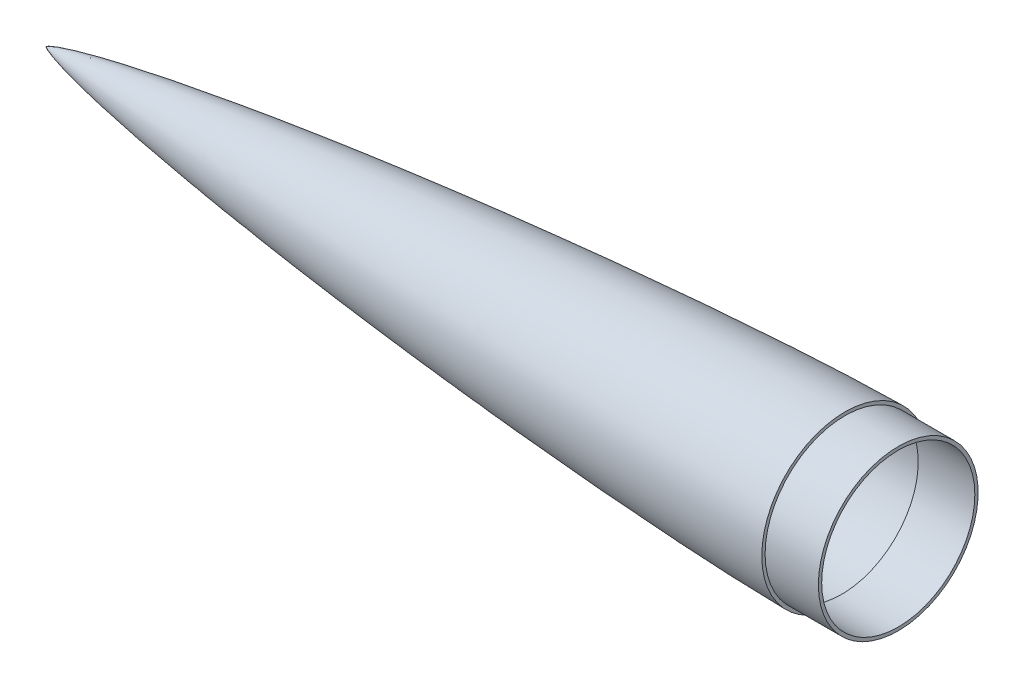
ISO-10303-21;
HEADER;
FILE_DESCRIPTION(('STEP AP214'),'2;1');
FILE_NAME('part.step','',(''),(''),'','','');
FILE_SCHEMA(('AUTOMOTIVE_DESIGN { 1 0 10303 214 1 1 1 1 }'));
ENDSEC;
DATA;
#1=APPLICATION_CONTEXT('core data for automotive mechanical design processes');
#2=APPLICATION_PROTOCOL_DEFINITION('international standard','automotive_design',2000,#1);
#3=PRODUCT_CONTEXT('',#1,'mechanical');
#4=PRODUCT('Part','Part','',(#3));
#5=PRODUCT_RELATED_PRODUCT_CATEGORY('part','',(#4));
#6=PRODUCT_DEFINITION_FORMATION('','',#4);
#7=PRODUCT_DEFINITION_CONTEXT('part definition',#1,'design');
#8=PRODUCT_DEFINITION('design','',#6,#7);
#9=PRODUCT_DEFINITION_SHAPE('','',#8);
#10=(LENGTH_UNIT() NAMED_UNIT(*) SI_UNIT(.MILLI.,.METRE.));
#11=(NAMED_UNIT(*) PLANE_ANGLE_UNIT() SI_UNIT($,.RADIAN.));
#12=(NAMED_UNIT(*) SI_UNIT($,.STERADIAN.) SOLID_ANGLE_UNIT());
#13=UNCERTAINTY_MEASURE_WITH_UNIT(LENGTH_MEASURE(1.E-05),#10,'distance_accuracy_value','');
#14=(GEOMETRIC_REPRESENTATION_CONTEXT(3) GLOBAL_UNCERTAINTY_ASSIGNED_CONTEXT((#13)) GLOBAL_UNIT_ASSIGNED_CONTEXT((#10,
#11,#12)) REPRESENTATION_CONTEXT('',''));
#15=CARTESIAN_POINT('',(0.,0.,0.));
#16=DIRECTION('',(0.,0.,1.));
#17=DIRECTION('',(1.,0.,0.));
#18=AXIS2_PLACEMENT_3D('',#15,#16,#17);
#19=CARTESIAN_POINT('',(0.,0.,0.));
#20=CARTESIAN_POINT('',(0.00304978367792177,0.00739151674115165,0.));
#21=CARTESIAN_POINT('',(0.0105162480931291,0.0213481993707133,0.));
#22=CARTESIAN_POINT('',(0.031106970511013,0.0458297069783124,0.));
#23=CARTESIAN_POINT('',(0.0655842706118951,0.0787989321659325,0.));
#24=CARTESIAN_POINT('',(0.108492279187186,0.114236912652269,0.));
#25=CARTESIAN_POINT('',(0.169582219597137,0.159319643301048,0.));
#26=CARTESIAN_POINT('',(0.242948898103035,0.208369013861671,0.));
#27=CARTESIAN_POINT('',(0.353595606596034,0.276354908936021,0.));
#28=CARTESIAN_POINT('',(0.521636884695428,0.369995092860291,0.));
#29=CARTESIAN_POINT('',(0.771175835612025,0.496239018169716,0.));
#30=CARTESIAN_POINT('',(1.18040312177665,0.683204498458494,0.));
#31=CARTESIAN_POINT('',(1.86846602037808,0.965449012260416,0.));
#32=CARTESIAN_POINT('',(3.09939453193652,1.41294955094824,0.));
#33=CARTESIAN_POINT('',(5.36695500098124,2.13463571196234,0.));
#34=CARTESIAN_POINT('',(9.58844178018962,3.29668288176902,0.));
#35=CARTESIAN_POINT('',(16.8729115028801,5.01868496904869,0.));
#36=CARTESIAN_POINT('',(29.3641074140737,7.56366889165502,0.));
#37=CARTESIAN_POINT('',(46.5721643306675,10.5748765224855,0.));
#38=CARTESIAN_POINT('',(67.5030914497933,13.802490116729,0.));
#39=CARTESIAN_POINT('',(90.9082899046555,17.0331511851608,0.));
#40=CARTESIAN_POINT('',(114.349996322787,19.9842675290656,0.));
#41=CARTESIAN_POINT('',(137.81972701144,22.7031567583947,0.));
#42=CARTESIAN_POINT('',(161.311837548981,25.2202713568444,0.));
#43=CARTESIAN_POINT('',(184.822932751374,27.5533534362843,0.));
#44=CARTESIAN_POINT('',(208.350495810996,29.7136231848693,0.));
#45=CARTESIAN_POINT('',(231.892861419399,31.7061769330544,0.));
#46=CARTESIAN_POINT('',(255.448769769799,33.5316303890237,0.));
#47=CARTESIAN_POINT('',(279.01737419615,35.1854099881675,0.));
#48=CARTESIAN_POINT('',(302.59808158079,36.6571339908698,0.));
#49=CARTESIAN_POINT('',(323.241506392672,37.7686500367052,0.));
#50=CARTESIAN_POINT('',(340.943168520313,38.5739341039136,0.));
#51=CARTESIAN_POINT('',(355.171608915226,39.1048184976854,0.));
#52=CARTESIAN_POINT('',(364.711499731524,39.3935961864471,0.));
#53=CARTESIAN_POINT('',(372.512915975241,39.5736172162128,0.));
#54=CARTESIAN_POINT('',(377.362499082528,39.6479506177915,0.));
#55=CARTESIAN_POINT('',(379.787469507812,39.6717050435517,0.));
#56=CARTESIAN_POINT('',(381.,39.6748,0.));
#57=B_SPLINE_CURVE_WITH_KNOTS('',4,(#19,#20,#21,#22,#23,#24,#25,#26,#27,#28,#29,#30,#31,#32,#33,
#34,#35,#36,#37,#38,#39,#40,#41,#42,#43,#44,#45,#46,#47,#48,#49,#50,#51,#52,#53,#54,#55,#56),
.UNSPECIFIED.,.F.,.F.,(5,1,1,1,1,1,1,1,1,1,1,1,1,1,1,1,1,1,1,1,1,1,1,1,1,1,1,1,1,1,1,1,1,1,5),
(0.,8.28035107819392E-05,0.000165607021563878,0.000331214043127757,0.000496821064691635,
0.000662428086255514,0.000956601781560104,0.0012507754768647,0.00184995948648091,
0.00266685866771101,0.0038704562042377,0.00593892522002887,0.00959910429260154,
0.0163141309646787,0.0286655915074136,0.0515631349498639,0.0875986936748582,0.149159503881663,
0.210720313022022,0.27228112441168,0.333841936934638,0.395402749888465,0.456963562890997,
0.518524375716312,0.580085188206876,0.641646000226326,0.70320681332856,0.76476762642414,
0.826328438645239,0.887889251638776,0.918669658129785,0.949450064620794,0.974725032310397,
0.987362516155198,1.),.UNSPECIFIED.);
#58=CARTESIAN_POINT('',(-22.86,0.,0.));
#59=DIRECTION('',(-1.,0.,0.));
#60=AXIS1_PLACEMENT('',#58,#59);
#61=SURFACE_OF_REVOLUTION('',#57,#60);
#62=CARTESIAN_POINT('',(381.,0.,0.));
#63=DIRECTION('',(-1.,0.,0.));
#64=DIRECTION('',(0.,0.,1.));
#65=AXIS2_PLACEMENT_3D('',#62,#63,#64);
#66=CIRCLE('',#65,39.6748);
#67=CARTESIAN_POINT('',(381.,0.,39.6748));
#68=VERTEX_POINT('',#67);
#69=EDGE_CURVE('E75',#68,#68,#66,.T.);
#70=ORIENTED_EDGE('',*,*,#69,.T.);
#71=EDGE_LOOP('',(#70));
#72=FACE_BOUND('',#71,.T.);
#73=CARTESIAN_POINT('',(0.,0.,0.));
#74=VERTEX_POINT('',#73);
#75=VERTEX_LOOP('',#74);
#76=FACE_BOUND('',#75,.T.);
#77=ADVANCED_FACE('F43',(#72,#76),#61,.F.);
#78=CARTESIAN_POINT('',(406.4,0.,0.));
#79=DIRECTION('',(1.,0.,0.));
#80=DIRECTION('',(0.,0.,-1.));
#81=AXIS2_PLACEMENT_3D('',#78,#79,#80);
#82=PLANE('',#81);
#83=CARTESIAN_POINT('',(406.4,0.,0.));
#84=DIRECTION('',(1.,0.,0.));
#85=DIRECTION('',(0.,0.,-1.));
#86=AXIS2_PLACEMENT_3D('',#83,#84,#85);
#87=CIRCLE('',#86,36.5125);
#88=CARTESIAN_POINT('',(406.4,0.,-36.5125));
#89=VERTEX_POINT('',#88);
#90=EDGE_CURVE('E70',#89,#89,#87,.F.);
#91=ORIENTED_EDGE('',*,*,#90,.T.);
#92=EDGE_LOOP('',(#91));
#93=FACE_BOUND('',#92,.T.);
#94=CARTESIAN_POINT('',(406.4,0.,0.));
#95=DIRECTION('',(-1.,0.,0.));
#96=DIRECTION('',(0.,0.,1.));
#97=AXIS2_PLACEMENT_3D('',#94,#95,#96);
#98=CIRCLE('',#97,38.1);
#99=CARTESIAN_POINT('',(406.4,0.,38.1));
#100=VERTEX_POINT('',#99);
#101=EDGE_CURVE('E11',#100,#100,#98,.T.);
#102=ORIENTED_EDGE('',*,*,#101,.F.);
#103=EDGE_LOOP('',(#102));
#104=FACE_BOUND('',#103,.T.);
#105=ADVANCED_FACE('F100',(#93,#104),#82,.T.);
#106=CARTESIAN_POINT('',(-22.86,0.,0.));
#107=DIRECTION('',(-1.,0.,0.));
#108=DIRECTION('',(0.,0.,1.));
#109=AXIS2_PLACEMENT_3D('',#106,#107,#108);
#110=CYLINDRICAL_SURFACE('',#109,38.1);
#111=ORIENTED_EDGE('',*,*,#101,.T.);
#112=EDGE_LOOP('',(#111));
#113=FACE_BOUND('',#112,.T.);
#114=CARTESIAN_POINT('',(381.,0.,0.));
#115=DIRECTION('',(-1.,0.,0.));
#116=DIRECTION('',(0.,0.,1.));
#117=AXIS2_PLACEMENT_3D('',#114,#115,#116);
#118=CIRCLE('',#117,38.1);
#119=CARTESIAN_POINT('',(381.,0.,38.1));
#120=VERTEX_POINT('',#119);
#121=EDGE_CURVE('E51',#120,#120,#118,.T.);
#122=ORIENTED_EDGE('',*,*,#121,.F.);
#123=EDGE_LOOP('',(#122));
#124=FACE_BOUND('',#123,.T.);
#125=ADVANCED_FACE('F97',(#113,#124),#110,.T.);
#126=CARTESIAN_POINT('',(381.,0.,0.));
#127=DIRECTION('',(-1.,0.,0.));
#128=DIRECTION('',(0.,0.,1.));
#129=AXIS2_PLACEMENT_3D('',#126,#127,#128);
#130=PLANE('',#129);
#131=ORIENTED_EDGE('',*,*,#69,.F.);
#132=EDGE_LOOP('',(#131));
#133=FACE_BOUND('',#132,.T.);
#134=ORIENTED_EDGE('',*,*,#121,.T.);
#135=EDGE_LOOP('',(#134));
#136=FACE_BOUND('',#135,.T.);
#137=ADVANCED_FACE('F61',(#133,#136),#130,.F.);
#138=CARTESIAN_POINT('',(3.42695007344221,1.50776707383116,0.));
#139=CARTESIAN_POINT('',(4.0189021505002,1.70280551132643,0.));
#140=CARTESIAN_POINT('',(5.74617905654539,2.23902042779557,0.));
#141=CARTESIAN_POINT('',(9.60890930360132,3.30152127349527,0.));
#142=CARTESIAN_POINT('',(16.8729115028801,5.01868496904869,0.));
#143=CARTESIAN_POINT('',(29.3641074140737,7.56366889165502,0.));
#144=CARTESIAN_POINT('',(46.5721643306675,10.5748765224855,0.));
#145=CARTESIAN_POINT('',(67.5030914497933,13.802490116729,0.));
#146=CARTESIAN_POINT('',(90.9082899046555,17.0331511851608,0.));
#147=CARTESIAN_POINT('',(114.349996322787,19.9842675290656,0.));
#148=CARTESIAN_POINT('',(137.81972701144,22.7031567583947,0.));
#149=CARTESIAN_POINT('',(161.311837548981,25.2202713568444,0.));
#150=CARTESIAN_POINT('',(184.822932751374,27.5533534362843,0.));
#151=CARTESIAN_POINT('',(208.350495810996,29.7136231848693,0.));
#152=CARTESIAN_POINT('',(231.892861419399,31.7061769330544,0.));
#153=CARTESIAN_POINT('',(255.448769769799,33.5316303890237,0.));
#154=CARTESIAN_POINT('',(279.01737419615,35.1854099881675,0.));
#155=CARTESIAN_POINT('',(302.59808158079,36.6571339908698,0.));
#156=CARTESIAN_POINT('',(323.241506392672,37.7686500367052,0.));
#157=CARTESIAN_POINT('',(340.943168520313,38.5739341039136,0.));
#158=CARTESIAN_POINT('',(355.171608915226,39.1048184976854,0.));
#159=CARTESIAN_POINT('',(364.711499731524,39.3935961864471,0.));
#160=CARTESIAN_POINT('',(372.512915975241,39.5736172162128,0.));
#161=CARTESIAN_POINT('',(377.362499082528,39.6479506177915,0.));
#162=CARTESIAN_POINT('',(379.787469507812,39.6717050435517,0.));
#163=CARTESIAN_POINT('',(381.,39.6748,0.));
#164=B_SPLINE_CURVE_WITH_KNOTS('',4,(#138,#139,#140,#141,#142,#143,#144,#145,#146,#147,#148,
#149,#150,#151,#152,#153,#154,#155,#156,#157,#158,#159,#160,#161,#162,#163),.UNSPECIFIED.,.F.,
.F.,(5,1,1,1,1,1,1,1,1,1,1,1,1,1,1,1,1,1,1,1,1,1,5),(0.0098182634740601,0.0163141309646787,
0.0286655915074136,0.0515631349498639,0.0875986936748582,0.149159503881663,0.210720313022022,
0.27228112441168,0.333841936934638,0.395402749888465,0.456963562890997,0.518524375716312,
0.580085188206876,0.641646000226326,0.70320681332856,0.76476762642414,0.826328438645239,
0.887889251638776,0.918669658129785,0.949450064620794,0.974725032310397,0.987362516155198,1.),.UNSPECIFIED.);
#165=CARTESIAN_POINT('',(-22.86,0.,0.));
#166=DIRECTION('',(-1.,0.,0.));
#167=AXIS1_PLACEMENT('',#165,#166);
#168=SURFACE_OF_REVOLUTION('',#164,#167);
#169=OFFSET_SURFACE('',#168,1.5875,.F.);
#170=CARTESIAN_POINT('',(3.92373443417695,0.,0.));
#171=VERTEX_POINT('',#170);
#172=VERTEX_LOOP('',#171);
#173=FACE_BOUND('',#172,.T.);
#174=CARTESIAN_POINT('',(379.4125,0.,0.));
#175=DIRECTION('',(-1.,0.,0.));
#176=DIRECTION('',(0.,0.,1.));
#177=AXIS2_PLACEMENT_3D('',#174,#175,#176);
#178=CIRCLE('',#177,38.0782516259566);
#179=CARTESIAN_POINT('',(379.4125,0.,38.0782516259566));
#180=VERTEX_POINT('',#179);
#181=EDGE_CURVE('E65',#180,#180,#178,.T.);
#182=ORIENTED_EDGE('',*,*,#181,.F.);
#183=EDGE_LOOP('',(#182));
#184=FACE_BOUND('',#183,.T.);
#185=ADVANCED_FACE('F57',(#173,#184),#169,.T.);
#186=CARTESIAN_POINT('',(-22.86,0.,0.));
#187=DIRECTION('',(-1.,0.,0.));
#188=DIRECTION('',(0.,0.,1.));
#189=AXIS2_PLACEMENT_3D('',#186,#187,#188);
#190=CYLINDRICAL_SURFACE('',#189,36.5125);
#191=ORIENTED_EDGE('',*,*,#90,.F.);
#192=EDGE_LOOP('',(#191));
#193=FACE_BOUND('',#192,.T.);
#194=CARTESIAN_POINT('',(379.4125,0.,0.));
#195=DIRECTION('',(-1.,0.,0.));
#196=DIRECTION('',(0.,0.,1.));
#197=AXIS2_PLACEMENT_3D('',#194,#195,#196);
#198=CIRCLE('',#197,36.5125);
#199=CARTESIAN_POINT('',(379.4125,0.,36.5125));
#200=VERTEX_POINT('',#199);
#201=EDGE_CURVE('E67',#200,#200,#198,.T.);
#202=ORIENTED_EDGE('',*,*,#201,.T.);
#203=EDGE_LOOP('',(#202));
#204=FACE_BOUND('',#203,.T.);
#205=ADVANCED_FACE('F60',(#193,#204),#190,.F.);
#206=CARTESIAN_POINT('',(379.4125,0.,0.));
#207=DIRECTION('',(-1.,0.,0.));
#208=DIRECTION('',(0.,0.,1.));
#209=AXIS2_PLACEMENT_3D('',#206,#207,#208);
#210=PLANE('',#209);
#211=ORIENTED_EDGE('',*,*,#181,.T.);
#212=EDGE_LOOP('',(#211));
#213=FACE_BOUND('',#212,.T.);
#214=ORIENTED_EDGE('',*,*,#201,.F.);
#215=EDGE_LOOP('',(#214));
#216=FACE_BOUND('',#215,.T.);
#217=ADVANCED_FACE('F91',(#213,#216),#210,.T.);
#218=CLOSED_SHELL('',(#77,#105,#125,#137,#185,#205,#217));
#219=MANIFOLD_SOLID_BREP('B2',#218);
#220=ADVANCED_BREP_SHAPE_REPRESENTATION('',(#18,#219),#14);
#221=SHAPE_DEFINITION_REPRESENTATION(#9,#220);
ENDSEC;
END-ISO-10303-21;
